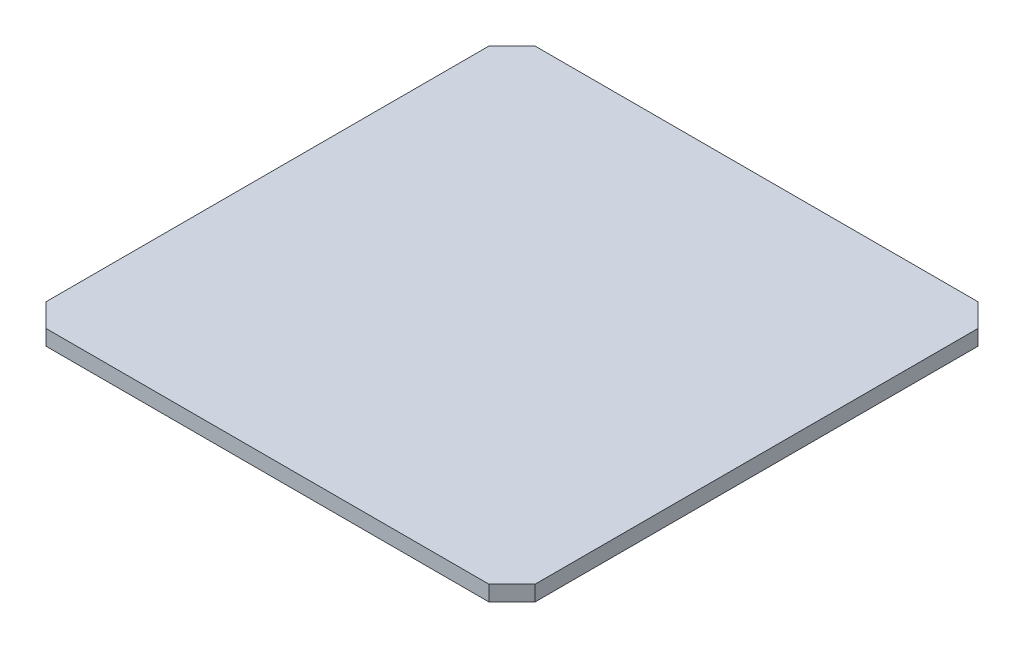
ISO-10303-21;
HEADER;
FILE_DESCRIPTION(('STEP AP214'),'2;1');
FILE_NAME('part.step','',(''),(''),'','','');
FILE_SCHEMA(('AUTOMOTIVE_DESIGN { 1 0 10303 214 1 1 1 1 }'));
ENDSEC;
DATA;
#1=APPLICATION_CONTEXT('core data for automotive mechanical design processes');
#2=APPLICATION_PROTOCOL_DEFINITION('international standard','automotive_design',2000,#1);
#3=PRODUCT_CONTEXT('',#1,'mechanical');
#4=PRODUCT('Part','Part','',(#3));
#5=PRODUCT_RELATED_PRODUCT_CATEGORY('part','',(#4));
#6=PRODUCT_DEFINITION_FORMATION('','',#4);
#7=PRODUCT_DEFINITION_CONTEXT('part definition',#1,'design');
#8=PRODUCT_DEFINITION('design','',#6,#7);
#9=PRODUCT_DEFINITION_SHAPE('','',#8);
#10=(LENGTH_UNIT() NAMED_UNIT(*) SI_UNIT(.MILLI.,.METRE.));
#11=(NAMED_UNIT(*) PLANE_ANGLE_UNIT() SI_UNIT($,.RADIAN.));
#12=(NAMED_UNIT(*) SI_UNIT($,.STERADIAN.) SOLID_ANGLE_UNIT());
#13=UNCERTAINTY_MEASURE_WITH_UNIT(LENGTH_MEASURE(1.E-05),#10,'distance_accuracy_value','');
#14=(GEOMETRIC_REPRESENTATION_CONTEXT(3) GLOBAL_UNCERTAINTY_ASSIGNED_CONTEXT((#13)) GLOBAL_UNIT_ASSIGNED_CONTEXT((#10,
#11,#12)) REPRESENTATION_CONTEXT('',''));
#15=CARTESIAN_POINT('',(0.,0.,0.));
#16=DIRECTION('',(0.,0.,1.));
#17=DIRECTION('',(1.,0.,0.));
#18=AXIS2_PLACEMENT_3D('',#15,#16,#17);
#19=CARTESIAN_POINT('',(0.,0.8,0.));
#20=DIRECTION('',(1.,0.,0.));
#21=DIRECTION('',(0.,0.,-1.));
#22=AXIS2_PLACEMENT_3D('',#19,#20,#21);
#23=PLANE('',#22);
#24=DIRECTION('',(0.,0.,1.));
#25=VECTOR('',#24,1.);
#26=CARTESIAN_POINT('',(0.,0.8,0.));
#27=LINE('',#26,#25);
#28=CARTESIAN_POINT('',(0.,0.8,-24.2));
#29=VERTEX_POINT('',#28);
#30=CARTESIAN_POINT('',(0.,0.8,-1.2));
#31=VERTEX_POINT('',#30);
#32=EDGE_CURVE('E118',#29,#31,#27,.T.);
#33=ORIENTED_EDGE('',*,*,#32,.F.);
#34=DIRECTION('',(0.,-1.,0.));
#35=VECTOR('',#34,1.);
#36=CARTESIAN_POINT('',(0.,0.8,-24.2));
#37=LINE('',#36,#35);
#38=CARTESIAN_POINT('',(0.,0.,-24.2));
#39=VERTEX_POINT('',#38);
#40=EDGE_CURVE('E103',#29,#39,#37,.T.);
#41=ORIENTED_EDGE('',*,*,#40,.T.);
#42=DIRECTION('',(0.,0.,1.));
#43=VECTOR('',#42,1.);
#44=CARTESIAN_POINT('',(0.,0.,0.));
#45=LINE('',#44,#43);
#46=CARTESIAN_POINT('',(0.,0.,-1.2));
#47=VERTEX_POINT('',#46);
#48=EDGE_CURVE('E115',#39,#47,#45,.T.);
#49=ORIENTED_EDGE('',*,*,#48,.T.);
#50=DIRECTION('',(0.,1.,0.));
#51=VECTOR('',#50,1.);
#52=CARTESIAN_POINT('',(0.,0.8,-1.2));
#53=LINE('',#52,#51);
#54=EDGE_CURVE('E120',#47,#31,#53,.T.);
#55=ORIENTED_EDGE('',*,*,#54,.T.);
#56=EDGE_LOOP('',(#33,#41,#49,#55));
#57=FACE_BOUND('',#56,.T.);
#58=ADVANCED_FACE('F33',(#57),#23,.F.);
#59=CARTESIAN_POINT('',(0.,0.8,0.));
#60=DIRECTION('',(0.,0.,-1.));
#61=DIRECTION('',(-1.,0.,0.));
#62=AXIS2_PLACEMENT_3D('',#59,#60,#61);
#63=PLANE('',#62);
#64=DIRECTION('',(1.,0.,0.));
#65=VECTOR('',#64,1.);
#66=CARTESIAN_POINT('',(0.,0.8,0.));
#67=LINE('',#66,#65);
#68=CARTESIAN_POINT('',(1.2,0.8,0.));
#69=VERTEX_POINT('',#68);
#70=CARTESIAN_POINT('',(24.2,0.8,0.));
#71=VERTEX_POINT('',#70);
#72=EDGE_CURVE('E160',#69,#71,#67,.T.);
#73=ORIENTED_EDGE('',*,*,#72,.F.);
#74=DIRECTION('',(0.,-1.,0.));
#75=VECTOR('',#74,1.);
#76=CARTESIAN_POINT('',(1.2,0.8,0.));
#77=LINE('',#76,#75);
#78=CARTESIAN_POINT('',(1.2,0.,0.));
#79=VERTEX_POINT('',#78);
#80=EDGE_CURVE('E153',#69,#79,#77,.T.);
#81=ORIENTED_EDGE('',*,*,#80,.T.);
#82=DIRECTION('',(1.,0.,0.));
#83=VECTOR('',#82,1.);
#84=CARTESIAN_POINT('',(0.,0.,0.));
#85=LINE('',#84,#83);
#86=CARTESIAN_POINT('',(24.2,0.,0.));
#87=VERTEX_POINT('',#86);
#88=EDGE_CURVE('E124',#79,#87,#85,.T.);
#89=ORIENTED_EDGE('',*,*,#88,.T.);
#90=DIRECTION('',(0.,1.,0.));
#91=VECTOR('',#90,1.);
#92=CARTESIAN_POINT('',(24.2,0.8,0.));
#93=LINE('',#92,#91);
#94=EDGE_CURVE('E151',#87,#71,#93,.T.);
#95=ORIENTED_EDGE('',*,*,#94,.T.);
#96=EDGE_LOOP('',(#73,#81,#89,#95));
#97=FACE_BOUND('',#96,.T.);
#98=ADVANCED_FACE('F158',(#97),#63,.F.);
#99=CARTESIAN_POINT('',(25.4,0.8,0.));
#100=DIRECTION('',(-1.,0.,0.));
#101=DIRECTION('',(0.,0.,1.));
#102=AXIS2_PLACEMENT_3D('',#99,#100,#101);
#103=PLANE('',#102);
#104=DIRECTION('',(0.,0.,-1.));
#105=VECTOR('',#104,1.);
#106=CARTESIAN_POINT('',(25.4,0.8,0.));
#107=LINE('',#106,#105);
#108=CARTESIAN_POINT('',(25.4,0.8,-1.2));
#109=VERTEX_POINT('',#108);
#110=CARTESIAN_POINT('',(25.4,0.8,-24.2));
#111=VERTEX_POINT('',#110);
#112=EDGE_CURVE('E168',#109,#111,#107,.T.);
#113=ORIENTED_EDGE('',*,*,#112,.F.);
#114=DIRECTION('',(0.,-1.,0.));
#115=VECTOR('',#114,1.);
#116=CARTESIAN_POINT('',(25.4,0.8,-1.2));
#117=LINE('',#116,#115);
#118=CARTESIAN_POINT('',(25.4,0.,-1.2));
#119=VERTEX_POINT('',#118);
#120=EDGE_CURVE('E11',#109,#119,#117,.T.);
#121=ORIENTED_EDGE('',*,*,#120,.T.);
#122=DIRECTION('',(0.,0.,-1.));
#123=VECTOR('',#122,1.);
#124=CARTESIAN_POINT('',(25.4,0.,0.));
#125=LINE('',#124,#123);
#126=CARTESIAN_POINT('',(25.4,0.,-24.2));
#127=VERTEX_POINT('',#126);
#128=EDGE_CURVE('E127',#119,#127,#125,.T.);
#129=ORIENTED_EDGE('',*,*,#128,.T.);
#130=DIRECTION('',(0.,1.,0.));
#131=VECTOR('',#130,1.);
#132=CARTESIAN_POINT('',(25.4,0.8,-24.2));
#133=LINE('',#132,#131);
#134=EDGE_CURVE('E41',#127,#111,#133,.T.);
#135=ORIENTED_EDGE('',*,*,#134,.T.);
#136=EDGE_LOOP('',(#113,#121,#129,#135));
#137=FACE_BOUND('',#136,.T.);
#138=ADVANCED_FACE('F167',(#137),#103,.F.);
#139=CARTESIAN_POINT('',(0.,0.8,-25.4));
#140=DIRECTION('',(0.,0.,1.));
#141=DIRECTION('',(1.,0.,0.));
#142=AXIS2_PLACEMENT_3D('',#139,#140,#141);
#143=PLANE('',#142);
#144=DIRECTION('',(-1.,0.,0.));
#145=VECTOR('',#144,1.);
#146=CARTESIAN_POINT('',(0.,0.,-25.4));
#147=LINE('',#146,#145);
#148=CARTESIAN_POINT('',(24.2,0.,-25.4));
#149=VERTEX_POINT('',#148);
#150=CARTESIAN_POINT('',(1.2,0.,-25.4));
#151=VERTEX_POINT('',#150);
#152=EDGE_CURVE('E134',#149,#151,#147,.T.);
#153=ORIENTED_EDGE('',*,*,#152,.T.);
#154=DIRECTION('',(0.,1.,0.));
#155=VECTOR('',#154,1.);
#156=CARTESIAN_POINT('',(1.2,0.8,-25.4));
#157=LINE('',#156,#155);
#158=CARTESIAN_POINT('',(1.2,0.8,-25.4));
#159=VERTEX_POINT('',#158);
#160=EDGE_CURVE('E104',#151,#159,#157,.T.);
#161=ORIENTED_EDGE('',*,*,#160,.T.);
#162=DIRECTION('',(-1.,0.,0.));
#163=VECTOR('',#162,1.);
#164=CARTESIAN_POINT('',(0.,0.8,-25.4));
#165=LINE('',#164,#163);
#166=CARTESIAN_POINT('',(24.2,0.8,-25.4));
#167=VERTEX_POINT('',#166);
#168=EDGE_CURVE('E130',#167,#159,#165,.T.);
#169=ORIENTED_EDGE('',*,*,#168,.F.);
#170=DIRECTION('',(0.,-1.,0.));
#171=VECTOR('',#170,1.);
#172=CARTESIAN_POINT('',(24.2,0.8,-25.4));
#173=LINE('',#172,#171);
#174=EDGE_CURVE('E109',#167,#149,#173,.T.);
#175=ORIENTED_EDGE('',*,*,#174,.T.);
#176=EDGE_LOOP('',(#153,#161,#169,#175));
#177=FACE_BOUND('',#176,.T.);
#178=ADVANCED_FACE('F191',(#177),#143,.F.);
#179=CARTESIAN_POINT('',(0.,0.8,0.));
#180=DIRECTION('',(0.,-1.,0.));
#181=DIRECTION('',(0.,0.,-1.));
#182=AXIS2_PLACEMENT_3D('',#179,#180,#181);
#183=PLANE('',#182);
#184=ORIENTED_EDGE('',*,*,#168,.T.);
#185=DIRECTION('',(0.707106781186549,0.,-0.707106781186547));
#186=VECTOR('',#185,1.);
#187=CARTESIAN_POINT('',(0.,0.8,-24.2));
#188=LINE('',#187,#186);
#189=EDGE_CURVE('E149',#159,#29,#188,.F.);
#190=ORIENTED_EDGE('',*,*,#189,.T.);
#191=ORIENTED_EDGE('',*,*,#32,.T.);
#192=DIRECTION('',(-0.707106781186547,0.,-0.707106781186549));
#193=VECTOR('',#192,1.);
#194=CARTESIAN_POINT('',(1.2,0.8,0.));
#195=LINE('',#194,#193);
#196=EDGE_CURVE('E147',#31,#69,#195,.F.);
#197=ORIENTED_EDGE('',*,*,#196,.T.);
#198=ORIENTED_EDGE('',*,*,#72,.T.);
#199=DIRECTION('',(-0.707106781186549,0.,0.707106781186547));
#200=VECTOR('',#199,1.);
#201=CARTESIAN_POINT('',(25.4,0.8,-1.2));
#202=LINE('',#201,#200);
#203=EDGE_CURVE('E54',#71,#109,#202,.F.);
#204=ORIENTED_EDGE('',*,*,#203,.T.);
#205=ORIENTED_EDGE('',*,*,#112,.T.);
#206=DIRECTION('',(0.707106781186547,0.,0.707106781186549));
#207=VECTOR('',#206,1.);
#208=CARTESIAN_POINT('',(24.2,0.8,-25.4));
#209=LINE('',#208,#207);
#210=EDGE_CURVE('E144',#111,#167,#209,.F.);
#211=ORIENTED_EDGE('',*,*,#210,.T.);
#212=EDGE_LOOP('',(#184,#190,#191,#197,#198,#204,#205,#211));
#213=FACE_BOUND('',#212,.T.);
#214=ADVANCED_FACE('F173',(#213),#183,.F.);
#215=CARTESIAN_POINT('',(0.,0.,0.));
#216=DIRECTION('',(0.,-1.,0.));
#217=DIRECTION('',(0.,0.,-1.));
#218=AXIS2_PLACEMENT_3D('',#215,#216,#217);
#219=PLANE('',#218);
#220=ORIENTED_EDGE('',*,*,#48,.F.);
#221=DIRECTION('',(-0.707106781186549,0.,0.707106781186547));
#222=VECTOR('',#221,1.);
#223=CARTESIAN_POINT('',(-12.1,0.,-12.1));
#224=LINE('',#223,#222);
#225=EDGE_CURVE('E99',#39,#151,#224,.F.);
#226=ORIENTED_EDGE('',*,*,#225,.T.);
#227=ORIENTED_EDGE('',*,*,#152,.F.);
#228=DIRECTION('',(-0.707106781186547,0.,-0.707106781186549));
#229=VECTOR('',#228,1.);
#230=CARTESIAN_POINT('',(24.8,0.,-24.8));
#231=LINE('',#230,#229);
#232=EDGE_CURVE('E119',#149,#127,#231,.F.);
#233=ORIENTED_EDGE('',*,*,#232,.T.);
#234=ORIENTED_EDGE('',*,*,#128,.F.);
#235=DIRECTION('',(0.707106781186549,0.,-0.707106781186547));
#236=VECTOR('',#235,1.);
#237=CARTESIAN_POINT('',(12.1,0.,12.1));
#238=LINE('',#237,#236);
#239=EDGE_CURVE('E138',#119,#87,#238,.F.);
#240=ORIENTED_EDGE('',*,*,#239,.T.);
#241=ORIENTED_EDGE('',*,*,#88,.F.);
#242=DIRECTION('',(0.707106781186547,0.,0.707106781186549));
#243=VECTOR('',#242,1.);
#244=CARTESIAN_POINT('',(0.600000000000002,0.,-0.6));
#245=LINE('',#244,#243);
#246=EDGE_CURVE('E110',#79,#47,#245,.F.);
#247=ORIENTED_EDGE('',*,*,#246,.T.);
#248=EDGE_LOOP('',(#220,#226,#227,#233,#234,#240,#241,#247));
#249=FACE_BOUND('',#248,.T.);
#250=ADVANCED_FACE('F122',(#249),#219,.T.);
#251=CARTESIAN_POINT('',(0.,0.8,-24.2));
#252=DIRECTION('',(0.707106781186547,0.,0.707106781186549));
#253=DIRECTION('',(0.,-1.,0.));
#254=AXIS2_PLACEMENT_3D('',#251,#252,#253);
#255=PLANE('',#254);
#256=ORIENTED_EDGE('',*,*,#189,.F.);
#257=ORIENTED_EDGE('',*,*,#160,.F.);
#258=ORIENTED_EDGE('',*,*,#225,.F.);
#259=ORIENTED_EDGE('',*,*,#40,.F.);
#260=EDGE_LOOP('',(#256,#257,#258,#259));
#261=FACE_BOUND('',#260,.T.);
#262=ADVANCED_FACE('F102',(#261),#255,.F.);
#263=CARTESIAN_POINT('',(1.2,0.8,0.));
#264=DIRECTION('',(0.707106781186549,0.,-0.707106781186547));
#265=DIRECTION('',(0.,-1.,0.));
#266=AXIS2_PLACEMENT_3D('',#263,#264,#265);
#267=PLANE('',#266);
#268=ORIENTED_EDGE('',*,*,#196,.F.);
#269=ORIENTED_EDGE('',*,*,#54,.F.);
#270=ORIENTED_EDGE('',*,*,#246,.F.);
#271=ORIENTED_EDGE('',*,*,#80,.F.);
#272=EDGE_LOOP('',(#268,#269,#270,#271));
#273=FACE_BOUND('',#272,.T.);
#274=ADVANCED_FACE('F174',(#273),#267,.F.);
#275=CARTESIAN_POINT('',(25.4,0.8,-1.2));
#276=DIRECTION('',(-0.707106781186547,0.,-0.707106781186549));
#277=DIRECTION('',(0.,-1.,0.));
#278=AXIS2_PLACEMENT_3D('',#275,#276,#277);
#279=PLANE('',#278);
#280=ORIENTED_EDGE('',*,*,#203,.F.);
#281=ORIENTED_EDGE('',*,*,#94,.F.);
#282=ORIENTED_EDGE('',*,*,#239,.F.);
#283=ORIENTED_EDGE('',*,*,#120,.F.);
#284=EDGE_LOOP('',(#280,#281,#282,#283));
#285=FACE_BOUND('',#284,.T.);
#286=ADVANCED_FACE('F166',(#285),#279,.F.);
#287=CARTESIAN_POINT('',(24.2,0.8,-25.4));
#288=DIRECTION('',(-0.707106781186549,0.,0.707106781186547));
#289=DIRECTION('',(0.,-1.,0.));
#290=AXIS2_PLACEMENT_3D('',#287,#288,#289);
#291=PLANE('',#290);
#292=ORIENTED_EDGE('',*,*,#210,.F.);
#293=ORIENTED_EDGE('',*,*,#134,.F.);
#294=ORIENTED_EDGE('',*,*,#232,.F.);
#295=ORIENTED_EDGE('',*,*,#174,.F.);
#296=EDGE_LOOP('',(#292,#293,#294,#295));
#297=FACE_BOUND('',#296,.T.);
#298=ADVANCED_FACE('F35',(#297),#291,.F.);
#299=CLOSED_SHELL('',(#58,#98,#138,#178,#214,#250,#262,#274,#286,#298));
#300=MANIFOLD_SOLID_BREP('B2',#299);
#301=ADVANCED_BREP_SHAPE_REPRESENTATION('',(#18,#300),#14);
#302=SHAPE_DEFINITION_REPRESENTATION(#9,#301);
ENDSEC;
END-ISO-10303-21;
